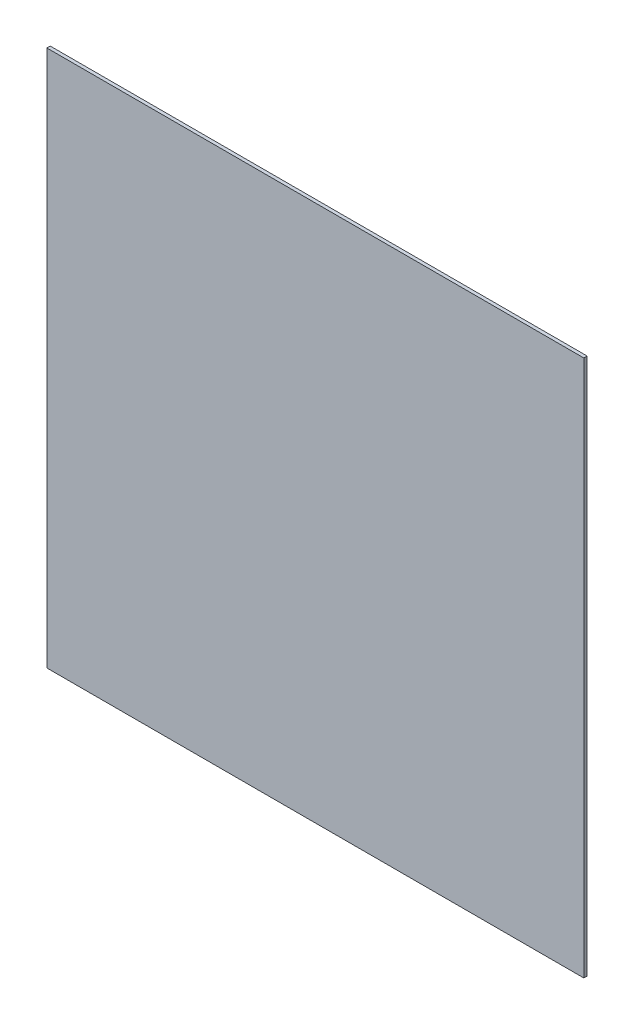
ISO-10303-21;
HEADER;
FILE_DESCRIPTION(('STEP AP214'),'2;1');
FILE_NAME('part.step','',(''),(''),'','','');
FILE_SCHEMA(('AUTOMOTIVE_DESIGN { 1 0 10303 214 1 1 1 1 }'));
ENDSEC;
DATA;
#1=APPLICATION_CONTEXT('core data for automotive mechanical design processes');
#2=APPLICATION_PROTOCOL_DEFINITION('international standard','automotive_design',2000,#1);
#3=PRODUCT_CONTEXT('',#1,'mechanical');
#4=PRODUCT('Part','Part','',(#3));
#5=PRODUCT_RELATED_PRODUCT_CATEGORY('part','',(#4));
#6=PRODUCT_DEFINITION_FORMATION('','',#4);
#7=PRODUCT_DEFINITION_CONTEXT('part definition',#1,'design');
#8=PRODUCT_DEFINITION('design','',#6,#7);
#9=PRODUCT_DEFINITION_SHAPE('','',#8);
#10=(LENGTH_UNIT() NAMED_UNIT(*) SI_UNIT(.MILLI.,.METRE.));
#11=(NAMED_UNIT(*) PLANE_ANGLE_UNIT() SI_UNIT($,.RADIAN.));
#12=(NAMED_UNIT(*) SI_UNIT($,.STERADIAN.) SOLID_ANGLE_UNIT());
#13=UNCERTAINTY_MEASURE_WITH_UNIT(LENGTH_MEASURE(1.E-05),#10,'distance_accuracy_value','');
#14=(GEOMETRIC_REPRESENTATION_CONTEXT(3) GLOBAL_UNCERTAINTY_ASSIGNED_CONTEXT((#13)) GLOBAL_UNIT_ASSIGNED_CONTEXT((#10,
#11,#12)) REPRESENTATION_CONTEXT('',''));
#15=CARTESIAN_POINT('',(0.,0.,0.));
#16=DIRECTION('',(0.,0.,1.));
#17=DIRECTION('',(1.,0.,0.));
#18=AXIS2_PLACEMENT_3D('',#15,#16,#17);
#19=CARTESIAN_POINT('',(160.,-160.,3.5));
#20=DIRECTION('',(-1.,0.,0.));
#21=DIRECTION('',(0.,0.,1.));
#22=AXIS2_PLACEMENT_3D('',#19,#20,#21);
#23=PLANE('',#22);
#24=DIRECTION('',(0.,0.,-1.));
#25=VECTOR('',#24,1.);
#26=CARTESIAN_POINT('',(160.,-160.,3.5));
#27=LINE('',#26,#25);
#28=CARTESIAN_POINT('',(160.,-160.,3.5));
#29=VERTEX_POINT('',#28);
#30=CARTESIAN_POINT('',(160.,-160.,1.5));
#31=VERTEX_POINT('',#30);
#32=EDGE_CURVE('E151',#29,#31,#27,.T.);
#33=ORIENTED_EDGE('',*,*,#32,.T.);
#34=DIRECTION('',(0.,1.,0.));
#35=VECTOR('',#34,1.);
#36=CARTESIAN_POINT('',(160.,160.,1.5));
#37=LINE('',#36,#35);
#38=CARTESIAN_POINT('',(160.,160.,1.5));
#39=VERTEX_POINT('',#38);
#40=EDGE_CURVE('E11',#31,#39,#37,.T.);
#41=ORIENTED_EDGE('',*,*,#40,.T.);
#42=DIRECTION('',(0.,0.,-1.));
#43=VECTOR('',#42,1.);
#44=CARTESIAN_POINT('',(160.,160.,3.5));
#45=LINE('',#44,#43);
#46=CARTESIAN_POINT('',(160.,160.,3.5));
#47=VERTEX_POINT('',#46);
#48=EDGE_CURVE('E93',#47,#39,#45,.T.);
#49=ORIENTED_EDGE('',*,*,#48,.F.);
#50=DIRECTION('',(0.,1.,0.));
#51=VECTOR('',#50,1.);
#52=CARTESIAN_POINT('',(160.,-160.,3.5));
#53=LINE('',#52,#51);
#54=EDGE_CURVE('E99',#29,#47,#53,.T.);
#55=ORIENTED_EDGE('',*,*,#54,.F.);
#56=EDGE_LOOP('',(#33,#41,#49,#55));
#57=FACE_BOUND('',#56,.T.);
#58=ADVANCED_FACE('F32',(#57),#23,.F.);
#59=CARTESIAN_POINT('',(-160.,160.,3.5));
#60=DIRECTION('',(0.,-1.,0.));
#61=DIRECTION('',(0.,0.,-1.));
#62=AXIS2_PLACEMENT_3D('',#59,#60,#61);
#63=PLANE('',#62);
#64=ORIENTED_EDGE('',*,*,#48,.T.);
#65=DIRECTION('',(-1.,0.,0.));
#66=VECTOR('',#65,1.);
#67=CARTESIAN_POINT('',(-160.,160.,1.5));
#68=LINE('',#67,#66);
#69=CARTESIAN_POINT('',(-160.,160.,1.5));
#70=VERTEX_POINT('',#69);
#71=EDGE_CURVE('E108',#39,#70,#68,.T.);
#72=ORIENTED_EDGE('',*,*,#71,.T.);
#73=DIRECTION('',(0.,0.,-1.));
#74=VECTOR('',#73,1.);
#75=CARTESIAN_POINT('',(-160.,160.,3.5));
#76=LINE('',#75,#74);
#77=CARTESIAN_POINT('',(-160.,160.,3.5));
#78=VERTEX_POINT('',#77);
#79=EDGE_CURVE('E95',#78,#70,#76,.T.);
#80=ORIENTED_EDGE('',*,*,#79,.F.);
#81=DIRECTION('',(-1.,0.,0.));
#82=VECTOR('',#81,1.);
#83=CARTESIAN_POINT('',(-160.,160.,3.5));
#84=LINE('',#83,#82);
#85=EDGE_CURVE('E88',#47,#78,#84,.T.);
#86=ORIENTED_EDGE('',*,*,#85,.F.);
#87=EDGE_LOOP('',(#64,#72,#80,#86));
#88=FACE_BOUND('',#87,.T.);
#89=ADVANCED_FACE('F90',(#88),#63,.F.);
#90=CARTESIAN_POINT('',(-160.,-160.,3.5));
#91=DIRECTION('',(1.,0.,0.));
#92=DIRECTION('',(0.,0.,-1.));
#93=AXIS2_PLACEMENT_3D('',#90,#91,#92);
#94=PLANE('',#93);
#95=ORIENTED_EDGE('',*,*,#79,.T.);
#96=DIRECTION('',(0.,-1.,0.));
#97=VECTOR('',#96,1.);
#98=CARTESIAN_POINT('',(-160.,-160.,1.5));
#99=LINE('',#98,#97);
#100=CARTESIAN_POINT('',(-160.,-160.,1.5));
#101=VERTEX_POINT('',#100);
#102=EDGE_CURVE('E56',#70,#101,#99,.T.);
#103=ORIENTED_EDGE('',*,*,#102,.T.);
#104=DIRECTION('',(0.,0.,-1.));
#105=VECTOR('',#104,1.);
#106=CARTESIAN_POINT('',(-160.,-160.,3.5));
#107=LINE('',#106,#105);
#108=CARTESIAN_POINT('',(-160.,-160.,3.5));
#109=VERTEX_POINT('',#108);
#110=EDGE_CURVE('E112',#109,#101,#107,.T.);
#111=ORIENTED_EDGE('',*,*,#110,.F.);
#112=DIRECTION('',(0.,-1.,0.));
#113=VECTOR('',#112,1.);
#114=CARTESIAN_POINT('',(-160.,-160.,3.5));
#115=LINE('',#114,#113);
#116=EDGE_CURVE('E98',#78,#109,#115,.T.);
#117=ORIENTED_EDGE('',*,*,#116,.F.);
#118=EDGE_LOOP('',(#95,#103,#111,#117));
#119=FACE_BOUND('',#118,.T.);
#120=ADVANCED_FACE('F149',(#119),#94,.F.);
#121=CARTESIAN_POINT('',(-160.,-160.,3.5));
#122=DIRECTION('',(0.,1.,0.));
#123=DIRECTION('',(0.,0.,1.));
#124=AXIS2_PLACEMENT_3D('',#121,#122,#123);
#125=PLANE('',#124);
#126=ORIENTED_EDGE('',*,*,#110,.T.);
#127=DIRECTION('',(1.,0.,0.));
#128=VECTOR('',#127,1.);
#129=CARTESIAN_POINT('',(160.,-160.,1.5));
#130=LINE('',#129,#128);
#131=EDGE_CURVE('E41',#101,#31,#130,.T.);
#132=ORIENTED_EDGE('',*,*,#131,.T.);
#133=ORIENTED_EDGE('',*,*,#32,.F.);
#134=DIRECTION('',(1.,0.,0.));
#135=VECTOR('',#134,1.);
#136=CARTESIAN_POINT('',(-160.,-160.,3.5));
#137=LINE('',#136,#135);
#138=EDGE_CURVE('E104',#109,#29,#137,.T.);
#139=ORIENTED_EDGE('',*,*,#138,.F.);
#140=EDGE_LOOP('',(#126,#132,#133,#139));
#141=FACE_BOUND('',#140,.T.);
#142=ADVANCED_FACE('F154',(#141),#125,.F.);
#143=CARTESIAN_POINT('',(0.,0.,3.5));
#144=DIRECTION('',(0.,0.,-1.));
#145=DIRECTION('',(-1.,0.,0.));
#146=AXIS2_PLACEMENT_3D('',#143,#144,#145);
#147=PLANE('',#146);
#148=ORIENTED_EDGE('',*,*,#54,.T.);
#149=ORIENTED_EDGE('',*,*,#85,.T.);
#150=ORIENTED_EDGE('',*,*,#116,.T.);
#151=ORIENTED_EDGE('',*,*,#138,.T.);
#152=EDGE_LOOP('',(#148,#149,#150,#151));
#153=FACE_BOUND('',#152,.T.);
#154=ADVANCED_FACE('F102',(#153),#147,.F.);
#155=CARTESIAN_POINT('',(0.,0.,0.));
#156=DIRECTION('',(0.,0.,-1.));
#157=DIRECTION('',(-1.,0.,0.));
#158=AXIS2_PLACEMENT_3D('',#155,#156,#157);
#159=PLANE('',#158);
#160=DIRECTION('',(0.,1.,0.));
#161=VECTOR('',#160,1.);
#162=CARTESIAN_POINT('',(-158.5,160.,0.));
#163=LINE('',#162,#161);
#164=CARTESIAN_POINT('',(-158.5,-158.5,0.));
#165=VERTEX_POINT('',#164);
#166=CARTESIAN_POINT('',(-158.5,158.5,0.));
#167=VERTEX_POINT('',#166);
#168=EDGE_CURVE('E119',#165,#167,#163,.T.);
#169=ORIENTED_EDGE('',*,*,#168,.T.);
#170=DIRECTION('',(1.,0.,0.));
#171=VECTOR('',#170,1.);
#172=CARTESIAN_POINT('',(160.,158.5,0.));
#173=LINE('',#172,#171);
#174=CARTESIAN_POINT('',(158.5,158.5,0.));
#175=VERTEX_POINT('',#174);
#176=EDGE_CURVE('E121',#167,#175,#173,.T.);
#177=ORIENTED_EDGE('',*,*,#176,.T.);
#178=DIRECTION('',(0.,-1.,0.));
#179=VECTOR('',#178,1.);
#180=CARTESIAN_POINT('',(158.5,-160.,0.));
#181=LINE('',#180,#179);
#182=CARTESIAN_POINT('',(158.5,-158.5,0.));
#183=VERTEX_POINT('',#182);
#184=EDGE_CURVE('E110',#175,#183,#181,.T.);
#185=ORIENTED_EDGE('',*,*,#184,.T.);
#186=DIRECTION('',(-1.,0.,0.));
#187=VECTOR('',#186,1.);
#188=CARTESIAN_POINT('',(-160.,-158.5,0.));
#189=LINE('',#188,#187);
#190=EDGE_CURVE('E117',#183,#165,#189,.T.);
#191=ORIENTED_EDGE('',*,*,#190,.T.);
#192=EDGE_LOOP('',(#169,#177,#185,#191));
#193=FACE_BOUND('',#192,.T.);
#194=ADVANCED_FACE('F142',(#193),#159,.T.);
#195=CARTESIAN_POINT('',(-160.,-160.,1.5));
#196=DIRECTION('',(0.,-0.707106781186547,-0.707106781186547));
#197=DIRECTION('',(-1.,0.,0.));
#198=AXIS2_PLACEMENT_3D('',#195,#196,#197);
#199=PLANE('',#198);
#200=DIRECTION('',(0.577350269189626,0.577350269189626,-0.577350269189626));
#201=VECTOR('',#200,1.);
#202=CARTESIAN_POINT('',(-160.,-160.,1.5));
#203=LINE('',#202,#201);
#204=EDGE_CURVE('E129',#165,#101,#203,.F.);
#205=ORIENTED_EDGE('',*,*,#204,.F.);
#206=ORIENTED_EDGE('',*,*,#190,.F.);
#207=DIRECTION('',(-0.577350269189626,0.577350269189626,-0.577350269189626));
#208=VECTOR('',#207,1.);
#209=CARTESIAN_POINT('',(160.,-160.,1.5));
#210=LINE('',#209,#208);
#211=EDGE_CURVE('E36',#31,#183,#210,.T.);
#212=ORIENTED_EDGE('',*,*,#211,.F.);
#213=ORIENTED_EDGE('',*,*,#131,.F.);
#214=EDGE_LOOP('',(#205,#206,#212,#213));
#215=FACE_BOUND('',#214,.T.);
#216=ADVANCED_FACE('F34',(#215),#199,.T.);
#217=CARTESIAN_POINT('',(160.,-160.,1.5));
#218=DIRECTION('',(0.707106781186547,0.,-0.707106781186547));
#219=DIRECTION('',(0.,-1.,0.));
#220=AXIS2_PLACEMENT_3D('',#217,#218,#219);
#221=PLANE('',#220);
#222=ORIENTED_EDGE('',*,*,#211,.T.);
#223=ORIENTED_EDGE('',*,*,#184,.F.);
#224=DIRECTION('',(0.577350269189626,0.577350269189626,0.577350269189626));
#225=VECTOR('',#224,1.);
#226=CARTESIAN_POINT('',(53.3333333333333,53.3333333333333,-105.166666666667));
#227=LINE('',#226,#225);
#228=EDGE_CURVE('E128',#39,#175,#227,.F.);
#229=ORIENTED_EDGE('',*,*,#228,.F.);
#230=ORIENTED_EDGE('',*,*,#40,.F.);
#231=EDGE_LOOP('',(#222,#223,#229,#230));
#232=FACE_BOUND('',#231,.T.);
#233=ADVANCED_FACE('F138',(#232),#221,.T.);
#234=CARTESIAN_POINT('',(-160.,-160.,1.5));
#235=DIRECTION('',(-0.707106781186547,0.,-0.707106781186547));
#236=DIRECTION('',(0.,1.,0.));
#237=AXIS2_PLACEMENT_3D('',#234,#235,#236);
#238=PLANE('',#237);
#239=ORIENTED_EDGE('',*,*,#204,.T.);
#240=ORIENTED_EDGE('',*,*,#102,.F.);
#241=DIRECTION('',(0.577350269189626,-0.577350269189626,-0.577350269189626));
#242=VECTOR('',#241,1.);
#243=CARTESIAN_POINT('',(-53.3333333333333,53.3333333333333,-105.166666666667));
#244=LINE('',#243,#242);
#245=EDGE_CURVE('E126',#167,#70,#244,.F.);
#246=ORIENTED_EDGE('',*,*,#245,.F.);
#247=ORIENTED_EDGE('',*,*,#168,.F.);
#248=EDGE_LOOP('',(#239,#240,#246,#247));
#249=FACE_BOUND('',#248,.T.);
#250=ADVANCED_FACE('F148',(#249),#238,.T.);
#251=CARTESIAN_POINT('',(-160.,160.,1.5));
#252=DIRECTION('',(0.,0.707106781186547,-0.707106781186547));
#253=DIRECTION('',(1.,0.,0.));
#254=AXIS2_PLACEMENT_3D('',#251,#252,#253);
#255=PLANE('',#254);
#256=ORIENTED_EDGE('',*,*,#228,.T.);
#257=ORIENTED_EDGE('',*,*,#176,.F.);
#258=ORIENTED_EDGE('',*,*,#245,.T.);
#259=ORIENTED_EDGE('',*,*,#71,.F.);
#260=EDGE_LOOP('',(#256,#257,#258,#259));
#261=FACE_BOUND('',#260,.T.);
#262=ADVANCED_FACE('F146',(#261),#255,.T.);
#263=CLOSED_SHELL('',(#58,#89,#120,#142,#154,#194,#216,#233,#250,#262));
#264=MANIFOLD_SOLID_BREP('B2',#263);
#265=ADVANCED_BREP_SHAPE_REPRESENTATION('',(#18,#264),#14);
#266=SHAPE_DEFINITION_REPRESENTATION(#9,#265);
ENDSEC;
END-ISO-10303-21;
